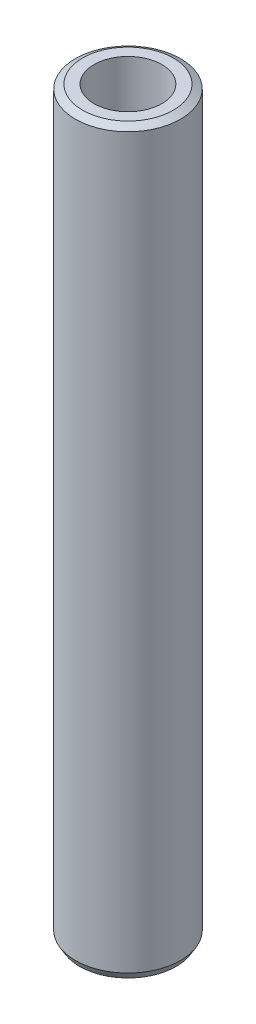
ISO-10303-21;
HEADER;
FILE_DESCRIPTION(('STEP AP214'),'2;1');
FILE_NAME('part.step','',(''),(''),'','','');
FILE_SCHEMA(('AUTOMOTIVE_DESIGN { 1 0 10303 214 1 1 1 1 }'));
ENDSEC;
DATA;
#1=APPLICATION_CONTEXT('core data for automotive mechanical design processes');
#2=APPLICATION_PROTOCOL_DEFINITION('international standard','automotive_design',2000,#1);
#3=PRODUCT_CONTEXT('',#1,'mechanical');
#4=PRODUCT('Part','Part','',(#3));
#5=PRODUCT_RELATED_PRODUCT_CATEGORY('part','',(#4));
#6=PRODUCT_DEFINITION_FORMATION('','',#4);
#7=PRODUCT_DEFINITION_CONTEXT('part definition',#1,'design');
#8=PRODUCT_DEFINITION('design','',#6,#7);
#9=PRODUCT_DEFINITION_SHAPE('','',#8);
#10=(LENGTH_UNIT() NAMED_UNIT(*) SI_UNIT(.MILLI.,.METRE.));
#11=(NAMED_UNIT(*) PLANE_ANGLE_UNIT() SI_UNIT($,.RADIAN.));
#12=(NAMED_UNIT(*) SI_UNIT($,.STERADIAN.) SOLID_ANGLE_UNIT());
#13=UNCERTAINTY_MEASURE_WITH_UNIT(LENGTH_MEASURE(1.E-05),#10,'distance_accuracy_value','');
#14=(GEOMETRIC_REPRESENTATION_CONTEXT(3) GLOBAL_UNCERTAINTY_ASSIGNED_CONTEXT((#13)) GLOBAL_UNIT_ASSIGNED_CONTEXT((#10,
#11,#12)) REPRESENTATION_CONTEXT('',''));
#15=CARTESIAN_POINT('',(0.,0.,0.));
#16=DIRECTION('',(0.,0.,1.));
#17=DIRECTION('',(1.,0.,0.));
#18=AXIS2_PLACEMENT_3D('',#15,#16,#17);
#19=CARTESIAN_POINT('',(0.,281.69962885214,0.));
#20=DIRECTION('',(0.,-1.,0.));
#21=DIRECTION('',(0.,0.,-1.));
#22=AXIS2_PLACEMENT_3D('',#19,#20,#21);
#23=CYLINDRICAL_SURFACE('',#22,20.);
#24=CARTESIAN_POINT('',(0.,280.114493160259,0.));
#25=DIRECTION('',(0.,1.,0.));
#26=DIRECTION('',(0.,0.,1.));
#27=AXIS2_PLACEMENT_3D('',#24,#25,#26);
#28=CIRCLE('',#27,20.);
#29=CARTESIAN_POINT('',(0.,280.114493160259,20.));
#30=VERTEX_POINT('',#29);
#31=EDGE_CURVE('E50',#30,#30,#28,.F.);
#32=ORIENTED_EDGE('',*,*,#31,.T.);
#33=EDGE_LOOP('',(#32));
#34=FACE_BOUND('',#33,.T.);
#35=CARTESIAN_POINT('',(0.,2.74553555522922,0.));
#36=DIRECTION('',(0.,1.,0.));
#37=DIRECTION('',(0.,0.,1.));
#38=AXIS2_PLACEMENT_3D('',#35,#36,#37);
#39=CIRCLE('',#38,20.);
#40=CARTESIAN_POINT('',(0.,2.74553555522922,20.));
#41=VERTEX_POINT('',#40);
#42=EDGE_CURVE('E51',#41,#41,#39,.T.);
#43=ORIENTED_EDGE('',*,*,#42,.T.);
#44=EDGE_LOOP('',(#43));
#45=FACE_BOUND('',#44,.T.);
#46=ADVANCED_FACE('F39',(#34,#45),#23,.T.);
#47=CARTESIAN_POINT('',(0.,281.69962885214,0.));
#48=DIRECTION('',(0.,1.,0.));
#49=DIRECTION('',(0.,0.,1.));
#50=AXIS2_PLACEMENT_3D('',#47,#48,#49);
#51=PLANE('',#50);
#52=CARTESIAN_POINT('',(0.,281.69962885214,0.));
#53=DIRECTION('',(0.,1.,0.));
#54=DIRECTION('',(0.,0.,1.));
#55=AXIS2_PLACEMENT_3D('',#52,#53,#54);
#56=CIRCLE('',#55,17.2544644447709);
#57=CARTESIAN_POINT('',(0.,281.69962885214,17.2544644447709));
#58=VERTEX_POINT('',#57);
#59=EDGE_CURVE('E54',#58,#58,#56,.T.);
#60=ORIENTED_EDGE('',*,*,#59,.T.);
#61=EDGE_LOOP('',(#60));
#62=FACE_BOUND('',#61,.T.);
#63=CARTESIAN_POINT('',(0.,281.69962885214,0.));
#64=DIRECTION('',(0.,1.,0.));
#65=DIRECTION('',(0.,0.,1.));
#66=AXIS2_PLACEMENT_3D('',#63,#64,#65);
#67=CIRCLE('',#66,12.9080739155858);
#68=CARTESIAN_POINT('',(0.,281.69962885214,12.9080739155858));
#69=VERTEX_POINT('',#68);
#70=EDGE_CURVE('E58',#69,#69,#67,.T.);
#71=ORIENTED_EDGE('',*,*,#70,.F.);
#72=EDGE_LOOP('',(#71));
#73=FACE_BOUND('',#72,.T.);
#74=ADVANCED_FACE('F69',(#62,#73),#51,.T.);
#75=CARTESIAN_POINT('',(0.,0.,0.));
#76=DIRECTION('',(0.,1.,0.));
#77=DIRECTION('',(0.,0.,1.));
#78=AXIS2_PLACEMENT_3D('',#75,#76,#77);
#79=PLANE('',#78);
#80=CARTESIAN_POINT('',(0.,0.,0.));
#81=DIRECTION('',(0.,1.,0.));
#82=DIRECTION('',(0.,0.,1.));
#83=AXIS2_PLACEMENT_3D('',#80,#81,#82);
#84=CIRCLE('',#83,18.4148643081187);
#85=CARTESIAN_POINT('',(0.,0.,18.4148643081187));
#86=VERTEX_POINT('',#85);
#87=EDGE_CURVE('E10',#86,#86,#84,.F.);
#88=ORIENTED_EDGE('',*,*,#87,.T.);
#89=EDGE_LOOP('',(#88));
#90=FACE_BOUND('',#89,.T.);
#91=CARTESIAN_POINT('',(0.,0.,0.));
#92=DIRECTION('',(0.,1.,0.));
#93=DIRECTION('',(0.,0.,1.));
#94=AXIS2_PLACEMENT_3D('',#91,#92,#93);
#95=CIRCLE('',#94,12.9080739155858);
#96=CARTESIAN_POINT('',(0.,0.,12.9080739155858));
#97=VERTEX_POINT('',#96);
#98=EDGE_CURVE('E63',#97,#97,#95,.T.);
#99=ORIENTED_EDGE('',*,*,#98,.T.);
#100=EDGE_LOOP('',(#99));
#101=FACE_BOUND('',#100,.T.);
#102=ADVANCED_FACE('F75',(#90,#101),#79,.F.);
#103=CARTESIAN_POINT('',(0.,281.69962885214,0.));
#104=DIRECTION('',(0.,-1.,0.));
#105=DIRECTION('',(0.,0.,-1.));
#106=AXIS2_PLACEMENT_3D('',#103,#104,#105);
#107=CYLINDRICAL_SURFACE('',#106,12.9080739155858);
#108=ORIENTED_EDGE('',*,*,#70,.T.);
#109=EDGE_LOOP('',(#108));
#110=FACE_BOUND('',#109,.T.);
#111=ORIENTED_EDGE('',*,*,#98,.F.);
#112=EDGE_LOOP('',(#111));
#113=FACE_BOUND('',#112,.T.);
#114=ADVANCED_FACE('F70',(#110,#113),#107,.F.);
#115=CARTESIAN_POINT('',(0.,281.69962885214,0.));
#116=DIRECTION('',(0.,-1.,0.));
#117=DIRECTION('',(0.,0.,-1.));
#118=AXIS2_PLACEMENT_3D('',#115,#116,#117);
#119=CONICAL_SURFACE('',#118,17.2544644447709,1.0471975511966);
#120=ORIENTED_EDGE('',*,*,#31,.F.);
#121=EDGE_LOOP('',(#120));
#122=FACE_BOUND('',#121,.T.);
#123=ORIENTED_EDGE('',*,*,#59,.F.);
#124=EDGE_LOOP('',(#123));
#125=FACE_BOUND('',#124,.T.);
#126=ADVANCED_FACE('F81',(#122,#125),#119,.T.);
#127=CARTESIAN_POINT('',(0.,2.74553555522922,0.));
#128=DIRECTION('',(0.,1.,0.));
#129=DIRECTION('',(0.,0.,1.));
#130=AXIS2_PLACEMENT_3D('',#127,#128,#129);
#131=CONICAL_SURFACE('',#130,20.,0.523598775598305);
#132=ORIENTED_EDGE('',*,*,#87,.F.);
#133=EDGE_LOOP('',(#132));
#134=FACE_BOUND('',#133,.T.);
#135=ORIENTED_EDGE('',*,*,#42,.F.);
#136=EDGE_LOOP('',(#135));
#137=FACE_BOUND('',#136,.T.);
#138=ADVANCED_FACE('F45',(#134,#137),#131,.T.);
#139=CLOSED_SHELL('',(#46,#74,#102,#114,#126,#138));
#140=MANIFOLD_SOLID_BREP('B2',#139);
#141=ADVANCED_BREP_SHAPE_REPRESENTATION('',(#18,#140),#14);
#142=SHAPE_DEFINITION_REPRESENTATION(#9,#141);
ENDSEC;
END-ISO-10303-21;
